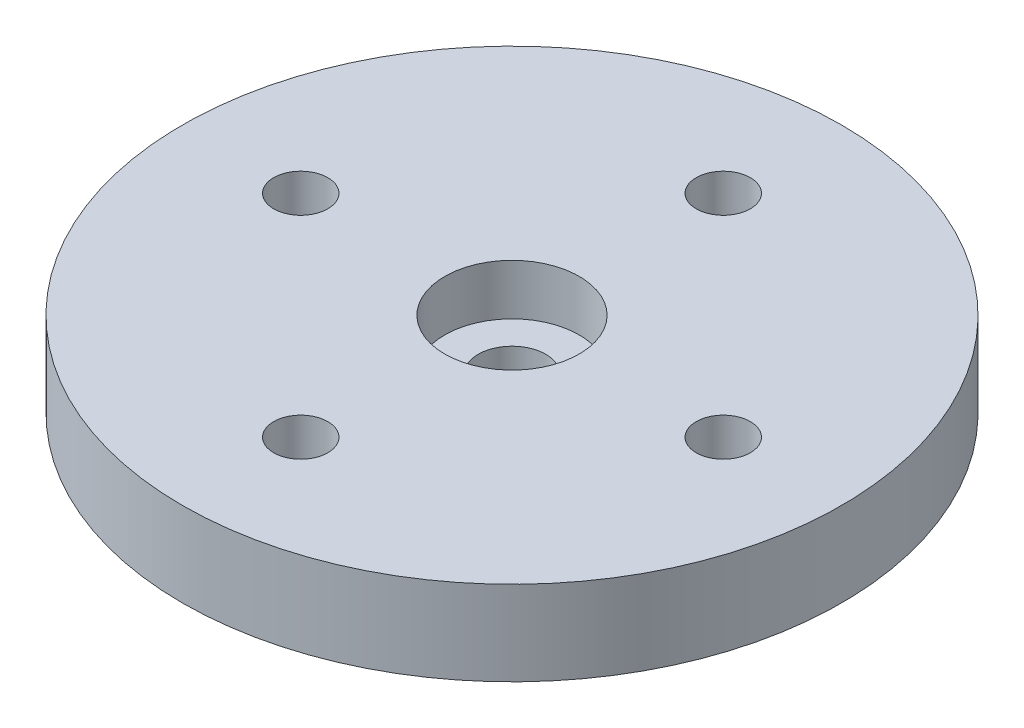
ISO-10303-21;
HEADER;
FILE_DESCRIPTION(('STEP AP214'),'2;1');
FILE_NAME('part.step','',(''),(''),'','','');
FILE_SCHEMA(('AUTOMOTIVE_DESIGN { 1 0 10303 214 1 1 1 1 }'));
ENDSEC;
DATA;
#1=APPLICATION_CONTEXT('core data for automotive mechanical design processes');
#2=APPLICATION_PROTOCOL_DEFINITION('international standard','automotive_design',2000,#1);
#3=PRODUCT_CONTEXT('',#1,'mechanical');
#4=PRODUCT('Part','Part','',(#3));
#5=PRODUCT_RELATED_PRODUCT_CATEGORY('part','',(#4));
#6=PRODUCT_DEFINITION_FORMATION('','',#4);
#7=PRODUCT_DEFINITION_CONTEXT('part definition',#1,'design');
#8=PRODUCT_DEFINITION('design','',#6,#7);
#9=PRODUCT_DEFINITION_SHAPE('','',#8);
#10=(LENGTH_UNIT() NAMED_UNIT(*) SI_UNIT(.MILLI.,.METRE.));
#11=(NAMED_UNIT(*) PLANE_ANGLE_UNIT() SI_UNIT($,.RADIAN.));
#12=(NAMED_UNIT(*) SI_UNIT($,.STERADIAN.) SOLID_ANGLE_UNIT());
#13=UNCERTAINTY_MEASURE_WITH_UNIT(LENGTH_MEASURE(1.E-05),#10,'distance_accuracy_value','');
#14=(GEOMETRIC_REPRESENTATION_CONTEXT(3) GLOBAL_UNCERTAINTY_ASSIGNED_CONTEXT((#13)) GLOBAL_UNIT_ASSIGNED_CONTEXT((#10,
#11,#12)) REPRESENTATION_CONTEXT('',''));
#15=CARTESIAN_POINT('',(0.,0.,0.));
#16=DIRECTION('',(0.,0.,1.));
#17=DIRECTION('',(1.,0.,0.));
#18=AXIS2_PLACEMENT_3D('',#15,#16,#17);
#19=CARTESIAN_POINT('',(0.,5.,0.));
#20=DIRECTION('',(0.,-1.,0.));
#21=DIRECTION('',(0.,0.,-1.));
#22=AXIS2_PLACEMENT_3D('',#19,#20,#21);
#23=CYLINDRICAL_SURFACE('',#22,19.5);
#24=CARTESIAN_POINT('',(0.,5.,0.));
#25=DIRECTION('',(0.,1.,0.));
#26=DIRECTION('',(0.,0.,1.));
#27=AXIS2_PLACEMENT_3D('',#24,#25,#26);
#28=CIRCLE('',#27,19.5);
#29=CARTESIAN_POINT('',(0.,5.,19.5));
#30=VERTEX_POINT('',#29);
#31=EDGE_CURVE('E10',#30,#30,#28,.T.);
#32=ORIENTED_EDGE('',*,*,#31,.F.);
#33=EDGE_LOOP('',(#32));
#34=FACE_BOUND('',#33,.T.);
#35=CARTESIAN_POINT('',(0.,0.,0.));
#36=DIRECTION('',(0.,1.,0.));
#37=DIRECTION('',(0.,0.,1.));
#38=AXIS2_PLACEMENT_3D('',#35,#36,#37);
#39=CIRCLE('',#38,19.5);
#40=CARTESIAN_POINT('',(0.,0.,19.5));
#41=VERTEX_POINT('',#40);
#42=EDGE_CURVE('E42',#41,#41,#39,.T.);
#43=ORIENTED_EDGE('',*,*,#42,.T.);
#44=EDGE_LOOP('',(#43));
#45=FACE_BOUND('',#44,.T.);
#46=ADVANCED_FACE('F35',(#34,#45),#23,.T.);
#47=CARTESIAN_POINT('',(0.,5.,0.));
#48=DIRECTION('',(0.,1.,0.));
#49=DIRECTION('',(0.,0.,1.));
#50=AXIS2_PLACEMENT_3D('',#47,#48,#49);
#51=PLANE('',#50);
#52=CARTESIAN_POINT('',(12.5,5.,0.));
#53=DIRECTION('',(0.,1.,0.));
#54=DIRECTION('',(-1.,0.,0.));
#55=AXIS2_PLACEMENT_3D('',#52,#53,#54);
#56=CIRCLE('',#55,1.6);
#57=CARTESIAN_POINT('',(10.9,5.,0.));
#58=VERTEX_POINT('',#57);
#59=EDGE_CURVE('E61',#58,#58,#56,.T.);
#60=ORIENTED_EDGE('',*,*,#59,.F.);
#61=EDGE_LOOP('',(#60));
#62=FACE_BOUND('',#61,.T.);
#63=CARTESIAN_POINT('',(0.,5.,12.5));
#64=DIRECTION('',(0.,1.,0.));
#65=DIRECTION('',(0.,0.,-1.));
#66=AXIS2_PLACEMENT_3D('',#63,#64,#65);
#67=CIRCLE('',#66,1.6);
#68=CARTESIAN_POINT('',(0.,5.,10.9));
#69=VERTEX_POINT('',#68);
#70=EDGE_CURVE('E71',#69,#69,#67,.T.);
#71=ORIENTED_EDGE('',*,*,#70,.F.);
#72=EDGE_LOOP('',(#71));
#73=FACE_BOUND('',#72,.T.);
#74=CARTESIAN_POINT('',(-12.5,5.,-1.30930550206618E-13));
#75=DIRECTION('',(0.,1.,0.));
#76=DIRECTION('',(1.,0.,0.));
#77=AXIS2_PLACEMENT_3D('',#74,#75,#76);
#78=CIRCLE('',#77,1.6);
#79=CARTESIAN_POINT('',(-10.9,5.,-1.1417143978017E-13));
#80=VERTEX_POINT('',#79);
#81=EDGE_CURVE('E64',#80,#80,#78,.T.);
#82=ORIENTED_EDGE('',*,*,#81,.F.);
#83=EDGE_LOOP('',(#82));
#84=FACE_BOUND('',#83,.T.);
#85=CARTESIAN_POINT('',(0.,5.,-12.5));
#86=DIRECTION('',(0.,1.,0.));
#87=DIRECTION('',(0.,0.,1.));
#88=AXIS2_PLACEMENT_3D('',#85,#86,#87);
#89=CIRCLE('',#88,1.6);
#90=CARTESIAN_POINT('',(0.,5.,-10.9));
#91=VERTEX_POINT('',#90);
#92=EDGE_CURVE('E58',#91,#91,#89,.T.);
#93=ORIENTED_EDGE('',*,*,#92,.F.);
#94=EDGE_LOOP('',(#93));
#95=FACE_BOUND('',#94,.T.);
#96=CARTESIAN_POINT('',(0.,5.,0.));
#97=DIRECTION('',(0.,1.,0.));
#98=DIRECTION('',(0.,0.,1.));
#99=AXIS2_PLACEMENT_3D('',#96,#97,#98);
#100=CIRCLE('',#99,3.98);
#101=CARTESIAN_POINT('',(0.,5.,3.98));
#102=VERTEX_POINT('',#101);
#103=EDGE_CURVE('E49',#102,#102,#100,.T.);
#104=ORIENTED_EDGE('',*,*,#103,.F.);
#105=EDGE_LOOP('',(#104));
#106=FACE_BOUND('',#105,.T.);
#107=ORIENTED_EDGE('',*,*,#31,.T.);
#108=EDGE_LOOP('',(#107));
#109=FACE_BOUND('',#108,.T.);
#110=ADVANCED_FACE('F92',(#62,#73,#84,#95,#106,#109),#51,.T.);
#111=CARTESIAN_POINT('',(0.,0.,0.));
#112=DIRECTION('',(0.,1.,0.));
#113=DIRECTION('',(0.,0.,1.));
#114=AXIS2_PLACEMENT_3D('',#111,#112,#113);
#115=PLANE('',#114);
#116=CARTESIAN_POINT('',(12.5,0.,0.));
#117=DIRECTION('',(0.,1.,0.));
#118=DIRECTION('',(-1.,0.,0.));
#119=AXIS2_PLACEMENT_3D('',#116,#117,#118);
#120=CIRCLE('',#119,1.6);
#121=CARTESIAN_POINT('',(10.9,0.,0.));
#122=VERTEX_POINT('',#121);
#123=EDGE_CURVE('E74',#122,#122,#120,.T.);
#124=ORIENTED_EDGE('',*,*,#123,.T.);
#125=EDGE_LOOP('',(#124));
#126=FACE_BOUND('',#125,.T.);
#127=CARTESIAN_POINT('',(0.,0.,12.5));
#128=DIRECTION('',(0.,1.,0.));
#129=DIRECTION('',(0.,0.,-1.));
#130=AXIS2_PLACEMENT_3D('',#127,#128,#129);
#131=CIRCLE('',#130,1.6);
#132=CARTESIAN_POINT('',(0.,0.,10.9));
#133=VERTEX_POINT('',#132);
#134=EDGE_CURVE('E67',#133,#133,#131,.T.);
#135=ORIENTED_EDGE('',*,*,#134,.T.);
#136=EDGE_LOOP('',(#135));
#137=FACE_BOUND('',#136,.T.);
#138=CARTESIAN_POINT('',(-12.5,0.,-1.30930550206618E-13));
#139=DIRECTION('',(0.,1.,0.));
#140=DIRECTION('',(1.,0.,0.));
#141=AXIS2_PLACEMENT_3D('',#138,#139,#140);
#142=CIRCLE('',#141,1.6);
#143=CARTESIAN_POINT('',(-10.9,0.,-1.1417143978017E-13));
#144=VERTEX_POINT('',#143);
#145=EDGE_CURVE('E68',#144,#144,#142,.T.);
#146=ORIENTED_EDGE('',*,*,#145,.T.);
#147=EDGE_LOOP('',(#146));
#148=FACE_BOUND('',#147,.T.);
#149=CARTESIAN_POINT('',(0.,0.,-12.5));
#150=DIRECTION('',(0.,1.,0.));
#151=DIRECTION('',(0.,0.,1.));
#152=AXIS2_PLACEMENT_3D('',#149,#150,#151);
#153=CIRCLE('',#152,1.6);
#154=CARTESIAN_POINT('',(0.,0.,-10.9));
#155=VERTEX_POINT('',#154);
#156=EDGE_CURVE('E57',#155,#155,#153,.T.);
#157=ORIENTED_EDGE('',*,*,#156,.T.);
#158=EDGE_LOOP('',(#157));
#159=FACE_BOUND('',#158,.T.);
#160=CARTESIAN_POINT('',(0.,0.,0.));
#161=DIRECTION('',(0.,1.,0.));
#162=DIRECTION('',(0.,0.,1.));
#163=AXIS2_PLACEMENT_3D('',#160,#161,#162);
#164=CIRCLE('',#163,2.);
#165=CARTESIAN_POINT('',(0.,0.,2.));
#166=VERTEX_POINT('',#165);
#167=EDGE_CURVE('E38',#166,#166,#164,.T.);
#168=ORIENTED_EDGE('',*,*,#167,.T.);
#169=EDGE_LOOP('',(#168));
#170=FACE_BOUND('',#169,.T.);
#171=ORIENTED_EDGE('',*,*,#42,.F.);
#172=EDGE_LOOP('',(#171));
#173=FACE_BOUND('',#172,.T.);
#174=ADVANCED_FACE('F82',(#126,#137,#148,#159,#170,#173),#115,.F.);
#175=CARTESIAN_POINT('',(0.,2.,0.));
#176=DIRECTION('',(0.,1.,0.));
#177=DIRECTION('',(0.,0.,1.));
#178=AXIS2_PLACEMENT_3D('',#175,#176,#177);
#179=CYLINDRICAL_SURFACE('',#178,3.98);
#180=CARTESIAN_POINT('',(0.,2.,0.));
#181=DIRECTION('',(0.,1.,0.));
#182=DIRECTION('',(0.,0.,1.));
#183=AXIS2_PLACEMENT_3D('',#180,#181,#182);
#184=CIRCLE('',#183,3.98);
#185=CARTESIAN_POINT('',(0.,2.,3.98));
#186=VERTEX_POINT('',#185);
#187=EDGE_CURVE('E47',#186,#186,#184,.T.);
#188=ORIENTED_EDGE('',*,*,#187,.F.);
#189=EDGE_LOOP('',(#188));
#190=FACE_BOUND('',#189,.T.);
#191=ORIENTED_EDGE('',*,*,#103,.T.);
#192=EDGE_LOOP('',(#191));
#193=FACE_BOUND('',#192,.T.);
#194=ADVANCED_FACE('F104',(#190,#193),#179,.F.);
#195=CARTESIAN_POINT('',(0.,2.,0.));
#196=DIRECTION('',(0.,1.,0.));
#197=DIRECTION('',(0.,0.,1.));
#198=AXIS2_PLACEMENT_3D('',#195,#196,#197);
#199=PLANE('',#198);
#200=CARTESIAN_POINT('',(0.,2.,0.));
#201=DIRECTION('',(0.,1.,0.));
#202=DIRECTION('',(0.,0.,1.));
#203=AXIS2_PLACEMENT_3D('',#200,#201,#202);
#204=CIRCLE('',#203,2.);
#205=CARTESIAN_POINT('',(0.,2.,2.));
#206=VERTEX_POINT('',#205);
#207=EDGE_CURVE('E54',#206,#206,#204,.T.);
#208=ORIENTED_EDGE('',*,*,#207,.F.);
#209=EDGE_LOOP('',(#208));
#210=FACE_BOUND('',#209,.T.);
#211=ORIENTED_EDGE('',*,*,#187,.T.);
#212=EDGE_LOOP('',(#211));
#213=FACE_BOUND('',#212,.T.);
#214=ADVANCED_FACE('F106',(#210,#213),#199,.T.);
#215=CARTESIAN_POINT('',(0.,-1.,0.));
#216=DIRECTION('',(0.,1.,0.));
#217=DIRECTION('',(0.,0.,1.));
#218=AXIS2_PLACEMENT_3D('',#215,#216,#217);
#219=CYLINDRICAL_SURFACE('',#218,2.);
#220=ORIENTED_EDGE('',*,*,#207,.T.);
#221=EDGE_LOOP('',(#220));
#222=FACE_BOUND('',#221,.T.);
#223=ORIENTED_EDGE('',*,*,#167,.F.);
#224=EDGE_LOOP('',(#223));
#225=FACE_BOUND('',#224,.T.);
#226=ADVANCED_FACE('F113',(#222,#225),#219,.F.);
#227=CARTESIAN_POINT('',(0.,0.,-12.5));
#228=DIRECTION('',(0.,1.,0.));
#229=DIRECTION('',(0.,0.,1.));
#230=AXIS2_PLACEMENT_3D('',#227,#228,#229);
#231=CYLINDRICAL_SURFACE('',#230,1.6);
#232=ORIENTED_EDGE('',*,*,#156,.F.);
#233=EDGE_LOOP('',(#232));
#234=FACE_BOUND('',#233,.T.);
#235=ORIENTED_EDGE('',*,*,#92,.T.);
#236=EDGE_LOOP('',(#235));
#237=FACE_BOUND('',#236,.T.);
#238=ADVANCED_FACE('F145',(#234,#237),#231,.F.);
#239=CARTESIAN_POINT('',(-12.5,0.,-1.30930550206618E-13));
#240=DIRECTION('',(0.,1.,0.));
#241=DIRECTION('',(1.,0.,0.));
#242=AXIS2_PLACEMENT_3D('',#239,#240,#241);
#243=CYLINDRICAL_SURFACE('',#242,1.6);
#244=ORIENTED_EDGE('',*,*,#145,.F.);
#245=EDGE_LOOP('',(#244));
#246=FACE_BOUND('',#245,.T.);
#247=ORIENTED_EDGE('',*,*,#81,.T.);
#248=EDGE_LOOP('',(#247));
#249=FACE_BOUND('',#248,.T.);
#250=ADVANCED_FACE('F140',(#246,#249),#243,.F.);
#251=CARTESIAN_POINT('',(0.,0.,12.5));
#252=DIRECTION('',(0.,1.,0.));
#253=DIRECTION('',(0.,0.,-1.));
#254=AXIS2_PLACEMENT_3D('',#251,#252,#253);
#255=CYLINDRICAL_SURFACE('',#254,1.6);
#256=ORIENTED_EDGE('',*,*,#134,.F.);
#257=EDGE_LOOP('',(#256));
#258=FACE_BOUND('',#257,.T.);
#259=ORIENTED_EDGE('',*,*,#70,.T.);
#260=EDGE_LOOP('',(#259));
#261=FACE_BOUND('',#260,.T.);
#262=ADVANCED_FACE('F88',(#258,#261),#255,.F.);
#263=CARTESIAN_POINT('',(12.5,0.,0.));
#264=DIRECTION('',(0.,1.,0.));
#265=DIRECTION('',(-1.,0.,0.));
#266=AXIS2_PLACEMENT_3D('',#263,#264,#265);
#267=CYLINDRICAL_SURFACE('',#266,1.6);
#268=ORIENTED_EDGE('',*,*,#123,.F.);
#269=EDGE_LOOP('',(#268));
#270=FACE_BOUND('',#269,.T.);
#271=ORIENTED_EDGE('',*,*,#59,.T.);
#272=EDGE_LOOP('',(#271));
#273=FACE_BOUND('',#272,.T.);
#274=ADVANCED_FACE('F85',(#270,#273),#267,.F.);
#275=CLOSED_SHELL('',(#46,#110,#174,#194,#214,#226,#238,#250,#262,#274));
#276=MANIFOLD_SOLID_BREP('B2',#275);
#277=ADVANCED_BREP_SHAPE_REPRESENTATION('',(#18,#276),#14);
#278=SHAPE_DEFINITION_REPRESENTATION(#9,#277);
ENDSEC;
END-ISO-10303-21;
